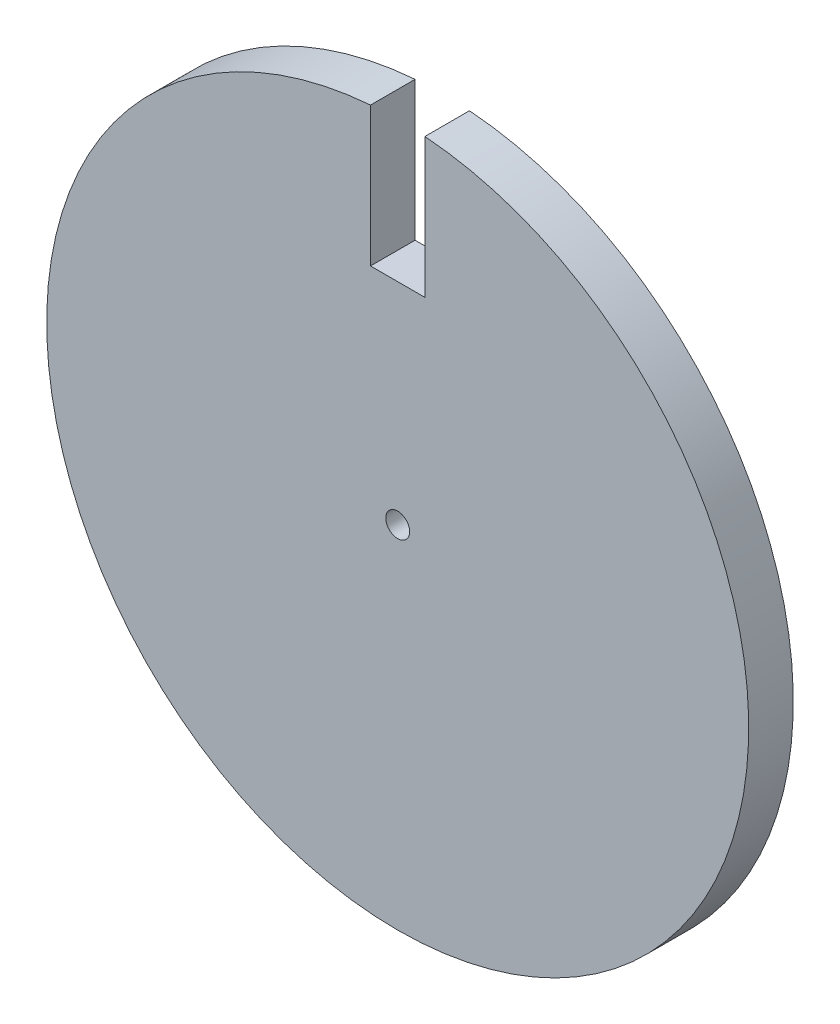
ISO-10303-21;
HEADER;
FILE_DESCRIPTION(('STEP AP214'),'2;1');
FILE_NAME('part.step','',(''),(''),'','','');
FILE_SCHEMA(('AUTOMOTIVE_DESIGN { 1 0 10303 214 1 1 1 1 }'));
ENDSEC;
DATA;
#1=APPLICATION_CONTEXT('core data for automotive mechanical design processes');
#2=APPLICATION_PROTOCOL_DEFINITION('international standard','automotive_design',2000,#1);
#3=PRODUCT_CONTEXT('',#1,'mechanical');
#4=PRODUCT('Part','Part','',(#3));
#5=PRODUCT_RELATED_PRODUCT_CATEGORY('part','',(#4));
#6=PRODUCT_DEFINITION_FORMATION('','',#4);
#7=PRODUCT_DEFINITION_CONTEXT('part definition',#1,'design');
#8=PRODUCT_DEFINITION('design','',#6,#7);
#9=PRODUCT_DEFINITION_SHAPE('','',#8);
#10=(LENGTH_UNIT() NAMED_UNIT(*) SI_UNIT(.MILLI.,.METRE.));
#11=(NAMED_UNIT(*) PLANE_ANGLE_UNIT() SI_UNIT($,.RADIAN.));
#12=(NAMED_UNIT(*) SI_UNIT($,.STERADIAN.) SOLID_ANGLE_UNIT());
#13=UNCERTAINTY_MEASURE_WITH_UNIT(LENGTH_MEASURE(1.E-05),#10,'distance_accuracy_value','');
#14=(GEOMETRIC_REPRESENTATION_CONTEXT(3) GLOBAL_UNCERTAINTY_ASSIGNED_CONTEXT((#13)) GLOBAL_UNIT_ASSIGNED_CONTEXT((#10,
#11,#12)) REPRESENTATION_CONTEXT('',''));
#15=CARTESIAN_POINT('',(0.,0.,0.));
#16=DIRECTION('',(0.,0.,1.));
#17=DIRECTION('',(1.,0.,0.));
#18=AXIS2_PLACEMENT_3D('',#15,#16,#17);
#19=CARTESIAN_POINT('',(0.,0.,1.5875));
#20=DIRECTION('',(0.,0.,1.));
#21=DIRECTION('',(1.,0.,0.));
#22=AXIS2_PLACEMENT_3D('',#19,#20,#21);
#23=PLANE('',#22);
#24=DIRECTION('',(0.,-1.,0.));
#25=VECTOR('',#24,1.);
#26=CARTESIAN_POINT('',(1.93699685119232,34.0447867361601,1.5875));
#27=LINE('',#26,#25);
#28=CARTESIAN_POINT('',(1.93699685119232,24.9248479072285,1.5875));
#29=VERTEX_POINT('',#28);
#30=CARTESIAN_POINT('',(1.93699685119232,15.,1.5875));
#31=VERTEX_POINT('',#30);
#32=EDGE_CURVE('E81',#29,#31,#27,.T.);
#33=ORIENTED_EDGE('',*,*,#32,.T.);
#34=DIRECTION('',(-1.,0.,0.));
#35=VECTOR('',#34,1.);
#36=CARTESIAN_POINT('',(1.93699685119232,15.,1.5875));
#37=LINE('',#36,#35);
#38=CARTESIAN_POINT('',(-1.93699685119232,15.,1.5875));
#39=VERTEX_POINT('',#38);
#40=EDGE_CURVE('E109',#31,#39,#37,.T.);
#41=ORIENTED_EDGE('',*,*,#40,.T.);
#42=DIRECTION('',(0.,1.,0.));
#43=VECTOR('',#42,1.);
#44=CARTESIAN_POINT('',(-1.93699685119232,15.,1.5875));
#45=LINE('',#44,#43);
#46=CARTESIAN_POINT('',(-1.93699685119232,24.9248479072285,1.5875));
#47=VERTEX_POINT('',#46);
#48=EDGE_CURVE('E106',#39,#47,#45,.T.);
#49=ORIENTED_EDGE('',*,*,#48,.T.);
#50=CARTESIAN_POINT('',(0.,0.,1.5875));
#51=DIRECTION('',(0.,0.,1.));
#52=DIRECTION('',(1.,0.,0.));
#53=AXIS2_PLACEMENT_3D('',#50,#51,#52);
#54=CIRCLE('',#53,25.);
#55=EDGE_CURVE('E11',#47,#29,#54,.T.);
#56=ORIENTED_EDGE('',*,*,#55,.T.);
#57=EDGE_LOOP('',(#33,#41,#49,#56));
#58=FACE_BOUND('',#57,.T.);
#59=CARTESIAN_POINT('',(0.,0.,1.5875));
#60=DIRECTION('',(0.,0.,1.));
#61=DIRECTION('',(1.,0.,0.));
#62=AXIS2_PLACEMENT_3D('',#59,#60,#61);
#63=CIRCLE('',#62,0.85);
#64=CARTESIAN_POINT('',(0.85,0.,1.5875));
#65=VERTEX_POINT('',#64);
#66=EDGE_CURVE('E94',#65,#65,#63,.T.);
#67=ORIENTED_EDGE('',*,*,#66,.F.);
#68=EDGE_LOOP('',(#67));
#69=FACE_BOUND('',#68,.T.);
#70=ADVANCED_FACE('F34',(#58,#69),#23,.T.);
#71=CARTESIAN_POINT('',(0.,0.,-1.5875));
#72=DIRECTION('',(0.,0.,1.));
#73=DIRECTION('',(1.,0.,0.));
#74=AXIS2_PLACEMENT_3D('',#71,#72,#73);
#75=PLANE('',#74);
#76=DIRECTION('',(-1.,0.,0.));
#77=VECTOR('',#76,1.);
#78=CARTESIAN_POINT('',(1.93699685119232,15.,-1.5875));
#79=LINE('',#78,#77);
#80=CARTESIAN_POINT('',(1.93699685119232,15.,-1.5875));
#81=VERTEX_POINT('',#80);
#82=CARTESIAN_POINT('',(-1.93699685119232,15.,-1.5875));
#83=VERTEX_POINT('',#82);
#84=EDGE_CURVE('E91',#81,#83,#79,.T.);
#85=ORIENTED_EDGE('',*,*,#84,.F.);
#86=DIRECTION('',(0.,-1.,0.));
#87=VECTOR('',#86,1.);
#88=CARTESIAN_POINT('',(1.93699685119232,34.0447867361601,-1.5875));
#89=LINE('',#88,#87);
#90=CARTESIAN_POINT('',(1.93699685119232,24.9248479072285,-1.5875));
#91=VERTEX_POINT('',#90);
#92=EDGE_CURVE('E78',#91,#81,#89,.T.);
#93=ORIENTED_EDGE('',*,*,#92,.F.);
#94=CARTESIAN_POINT('',(0.,0.,-1.5875));
#95=DIRECTION('',(0.,0.,1.));
#96=DIRECTION('',(1.,0.,0.));
#97=AXIS2_PLACEMENT_3D('',#94,#95,#96);
#98=CIRCLE('',#97,25.);
#99=CARTESIAN_POINT('',(-1.93699685119232,24.9248479072285,-1.5875));
#100=VERTEX_POINT('',#99);
#101=EDGE_CURVE('E38',#100,#91,#98,.T.);
#102=ORIENTED_EDGE('',*,*,#101,.F.);
#103=DIRECTION('',(0.,1.,0.));
#104=VECTOR('',#103,1.);
#105=CARTESIAN_POINT('',(-1.93699685119232,15.,-1.5875));
#106=LINE('',#105,#104);
#107=EDGE_CURVE('E49',#83,#100,#106,.T.);
#108=ORIENTED_EDGE('',*,*,#107,.F.);
#109=EDGE_LOOP('',(#85,#93,#102,#108));
#110=FACE_BOUND('',#109,.T.);
#111=CARTESIAN_POINT('',(0.,0.,-1.5875));
#112=DIRECTION('',(0.,0.,1.));
#113=DIRECTION('',(1.,0.,0.));
#114=AXIS2_PLACEMENT_3D('',#111,#112,#113);
#115=CIRCLE('',#114,0.85);
#116=CARTESIAN_POINT('',(0.85,0.,-1.5875));
#117=VERTEX_POINT('',#116);
#118=EDGE_CURVE('E92',#117,#117,#115,.T.);
#119=ORIENTED_EDGE('',*,*,#118,.T.);
#120=EDGE_LOOP('',(#119));
#121=FACE_BOUND('',#120,.T.);
#122=ADVANCED_FACE('F89',(#110,#121),#75,.F.);
#123=CARTESIAN_POINT('',(0.,0.,1.5875));
#124=DIRECTION('',(0.,0.,-1.));
#125=DIRECTION('',(-1.,0.,0.));
#126=AXIS2_PLACEMENT_3D('',#123,#124,#125);
#127=CYLINDRICAL_SURFACE('',#126,25.);
#128=ORIENTED_EDGE('',*,*,#101,.T.);
#129=DIRECTION('',(0.,0.,-1.));
#130=VECTOR('',#129,1.);
#131=CARTESIAN_POINT('',(1.93699685119232,24.9248479072285,1.5875));
#132=LINE('',#131,#130);
#133=EDGE_CURVE('E74',#29,#91,#132,.T.);
#134=ORIENTED_EDGE('',*,*,#133,.F.);
#135=ORIENTED_EDGE('',*,*,#55,.F.);
#136=DIRECTION('',(0.,0.,-1.));
#137=VECTOR('',#136,1.);
#138=CARTESIAN_POINT('',(-1.93699685119232,24.9248479072285,1.5875));
#139=LINE('',#138,#137);
#140=EDGE_CURVE('E85',#100,#47,#139,.F.);
#141=ORIENTED_EDGE('',*,*,#140,.F.);
#142=EDGE_LOOP('',(#128,#134,#135,#141));
#143=FACE_BOUND('',#142,.T.);
#144=ADVANCED_FACE('F36',(#143),#127,.T.);
#145=CARTESIAN_POINT('',(0.,0.,1.5875));
#146=DIRECTION('',(0.,0.,-1.));
#147=DIRECTION('',(-1.,0.,0.));
#148=AXIS2_PLACEMENT_3D('',#145,#146,#147);
#149=CYLINDRICAL_SURFACE('',#148,0.85);
#150=ORIENTED_EDGE('',*,*,#66,.T.);
#151=EDGE_LOOP('',(#150));
#152=FACE_BOUND('',#151,.T.);
#153=ORIENTED_EDGE('',*,*,#118,.F.);
#154=EDGE_LOOP('',(#153));
#155=FACE_BOUND('',#154,.T.);
#156=ADVANCED_FACE('F132',(#152,#155),#149,.F.);
#157=CARTESIAN_POINT('',(1.93699685119232,15.,1.5895));
#158=DIRECTION('',(0.,-1.,0.));
#159=DIRECTION('',(0.,0.,-1.));
#160=AXIS2_PLACEMENT_3D('',#157,#158,#159);
#161=PLANE('',#160);
#162=DIRECTION('',(0.,0.,-1.));
#163=VECTOR('',#162,1.);
#164=CARTESIAN_POINT('',(1.93699685119232,15.,1.5895));
#165=LINE('',#164,#163);
#166=EDGE_CURVE('E104',#31,#81,#165,.T.);
#167=ORIENTED_EDGE('',*,*,#166,.T.);
#168=ORIENTED_EDGE('',*,*,#84,.T.);
#169=DIRECTION('',(0.,0.,-1.));
#170=VECTOR('',#169,1.);
#171=CARTESIAN_POINT('',(-1.93699685119232,15.,1.5895));
#172=LINE('',#171,#170);
#173=EDGE_CURVE('E54',#39,#83,#172,.T.);
#174=ORIENTED_EDGE('',*,*,#173,.F.);
#175=ORIENTED_EDGE('',*,*,#40,.F.);
#176=EDGE_LOOP('',(#167,#168,#174,#175));
#177=FACE_BOUND('',#176,.T.);
#178=ADVANCED_FACE('F115',(#177),#161,.F.);
#179=CARTESIAN_POINT('',(1.93699685119232,34.0447867361601,1.5895));
#180=DIRECTION('',(1.,0.,0.));
#181=DIRECTION('',(0.,1.,0.));
#182=AXIS2_PLACEMENT_3D('',#179,#180,#181);
#183=PLANE('',#182);
#184=ORIENTED_EDGE('',*,*,#133,.T.);
#185=ORIENTED_EDGE('',*,*,#92,.T.);
#186=ORIENTED_EDGE('',*,*,#166,.F.);
#187=ORIENTED_EDGE('',*,*,#32,.F.);
#188=EDGE_LOOP('',(#184,#185,#186,#187));
#189=FACE_BOUND('',#188,.T.);
#190=ADVANCED_FACE('F76',(#189),#183,.F.);
#191=CARTESIAN_POINT('',(-1.93699685119232,15.,1.5895));
#192=DIRECTION('',(-1.,0.,0.));
#193=DIRECTION('',(0.,-1.,0.));
#194=AXIS2_PLACEMENT_3D('',#191,#192,#193);
#195=PLANE('',#194);
#196=ORIENTED_EDGE('',*,*,#140,.T.);
#197=ORIENTED_EDGE('',*,*,#48,.F.);
#198=ORIENTED_EDGE('',*,*,#173,.T.);
#199=ORIENTED_EDGE('',*,*,#107,.T.);
#200=EDGE_LOOP('',(#196,#197,#198,#199));
#201=FACE_BOUND('',#200,.T.);
#202=ADVANCED_FACE('F118',(#201),#195,.F.);
#203=CLOSED_SHELL('',(#70,#122,#144,#156,#178,#190,#202));
#204=MANIFOLD_SOLID_BREP('B2',#203);
#205=ADVANCED_BREP_SHAPE_REPRESENTATION('',(#18,#204),#14);
#206=SHAPE_DEFINITION_REPRESENTATION(#9,#205);
ENDSEC;
END-ISO-10303-21;
